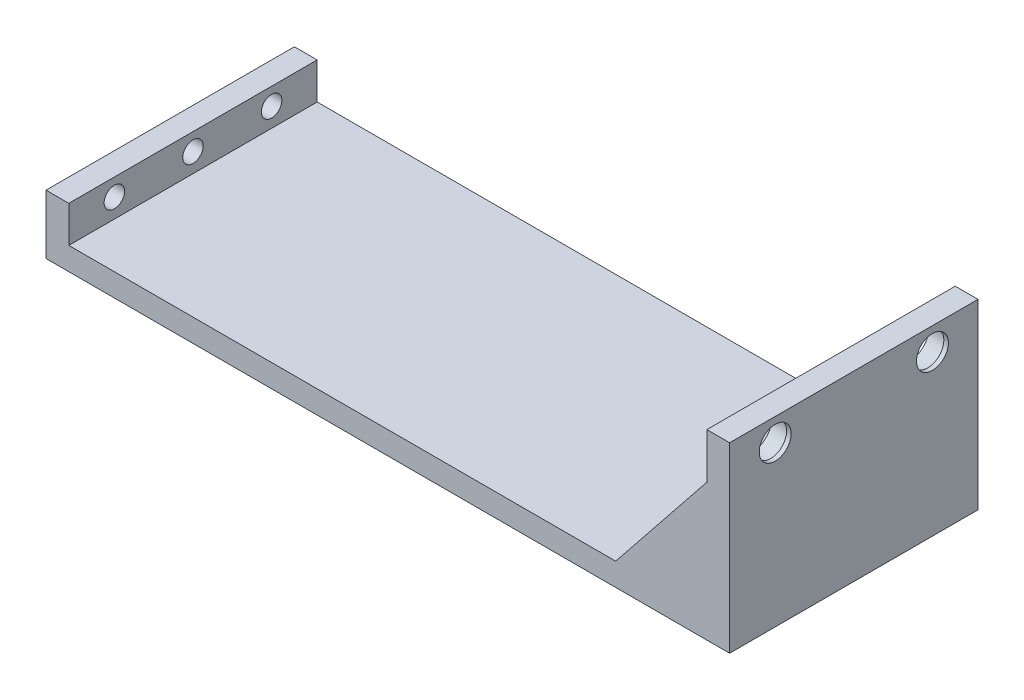
ISO-10303-21;
HEADER;
FILE_DESCRIPTION(('STEP AP214'),'2;1');
FILE_NAME('part.step','',(''),(''),'','','');
FILE_SCHEMA(('AUTOMOTIVE_DESIGN { 1 0 10303 214 1 1 1 1 }'));
ENDSEC;
DATA;
#1=APPLICATION_CONTEXT('core data for automotive mechanical design processes');
#2=APPLICATION_PROTOCOL_DEFINITION('international standard','automotive_design',2000,#1);
#3=PRODUCT_CONTEXT('',#1,'mechanical');
#4=PRODUCT('Part','Part','',(#3));
#5=PRODUCT_RELATED_PRODUCT_CATEGORY('part','',(#4));
#6=PRODUCT_DEFINITION_FORMATION('','',#4);
#7=PRODUCT_DEFINITION_CONTEXT('part definition',#1,'design');
#8=PRODUCT_DEFINITION('design','',#6,#7);
#9=PRODUCT_DEFINITION_SHAPE('','',#8);
#10=(LENGTH_UNIT() NAMED_UNIT(*) SI_UNIT(.MILLI.,.METRE.));
#11=(NAMED_UNIT(*) PLANE_ANGLE_UNIT() SI_UNIT($,.RADIAN.));
#12=(NAMED_UNIT(*) SI_UNIT($,.STERADIAN.) SOLID_ANGLE_UNIT());
#13=UNCERTAINTY_MEASURE_WITH_UNIT(LENGTH_MEASURE(1.E-05),#10,'distance_accuracy_value','');
#14=(GEOMETRIC_REPRESENTATION_CONTEXT(3) GLOBAL_UNCERTAINTY_ASSIGNED_CONTEXT((#13)) GLOBAL_UNIT_ASSIGNED_CONTEXT((#10,
#11,#12)) REPRESENTATION_CONTEXT('',''));
#15=CARTESIAN_POINT('',(0.,0.,0.));
#16=DIRECTION('',(0.,0.,1.));
#17=DIRECTION('',(1.,0.,0.));
#18=AXIS2_PLACEMENT_3D('',#15,#16,#17);
#19=CARTESIAN_POINT('',(51.8875361740346,40.,28.9393939393939));
#20=DIRECTION('',(1.,0.,0.));
#21=DIRECTION('',(0.,0.,-1.));
#22=AXIS2_PLACEMENT_3D('',#19,#20,#21);
#23=PLANE('',#22);
#24=DIRECTION('',(0.,-1.,0.));
#25=VECTOR('',#24,1.);
#26=CARTESIAN_POINT('',(51.8875361740346,40.,18.9393939393939));
#27=LINE('',#26,#25);
#28=CARTESIAN_POINT('',(51.8875361740346,30.,18.9393939393939));
#29=VERTEX_POINT('',#28);
#30=CARTESIAN_POINT('',(51.8875361740346,5.,18.9393939393939));
#31=VERTEX_POINT('',#30);
#32=EDGE_CURVE('E178',#29,#31,#27,.T.);
#33=ORIENTED_EDGE('',*,*,#32,.F.);
#34=DIRECTION('',(0.,0.,1.));
#35=VECTOR('',#34,1.);
#36=CARTESIAN_POINT('',(51.8875361740346,30.,28.9393939393939));
#37=LINE('',#36,#35);
#38=CARTESIAN_POINT('',(51.8875361740346,30.,28.9393939393939));
#39=VERTEX_POINT('',#38);
#40=EDGE_CURVE('E185',#29,#39,#37,.T.);
#41=ORIENTED_EDGE('',*,*,#40,.T.);
#42=DIRECTION('',(0.,-1.,0.));
#43=VECTOR('',#42,1.);
#44=CARTESIAN_POINT('',(51.8875361740346,40.,28.9393939393939));
#45=LINE('',#44,#43);
#46=CARTESIAN_POINT('',(51.8875361740346,40.,28.9393939393939));
#47=VERTEX_POINT('',#46);
#48=EDGE_CURVE('E229',#47,#39,#45,.T.);
#49=ORIENTED_EDGE('',*,*,#48,.F.);
#50=DIRECTION('',(0.,0.,1.));
#51=VECTOR('',#50,1.);
#52=CARTESIAN_POINT('',(51.8875361740346,40.,28.9393939393939));
#53=LINE('',#52,#51);
#54=CARTESIAN_POINT('',(51.8875361740346,40.,-25.5606060606061));
#55=VERTEX_POINT('',#54);
#56=EDGE_CURVE('E224',#55,#47,#53,.T.);
#57=ORIENTED_EDGE('',*,*,#56,.F.);
#58=DIRECTION('',(0.,-1.,0.));
#59=VECTOR('',#58,1.);
#60=CARTESIAN_POINT('',(51.8875361740346,40.,-25.5606060606061));
#61=LINE('',#60,#59);
#62=CARTESIAN_POINT('',(51.8875361740346,30.,-25.5606060606061));
#63=VERTEX_POINT('',#62);
#64=EDGE_CURVE('E233',#55,#63,#61,.T.);
#65=ORIENTED_EDGE('',*,*,#64,.T.);
#66=DIRECTION('',(0.,0.,-1.));
#67=VECTOR('',#66,1.);
#68=CARTESIAN_POINT('',(51.8875361740346,30.,28.9393939393939));
#69=LINE('',#68,#67);
#70=CARTESIAN_POINT('',(51.8875361740346,30.,-15.5606060606061));
#71=VERTEX_POINT('',#70);
#72=EDGE_CURVE('E201',#63,#71,#69,.F.);
#73=ORIENTED_EDGE('',*,*,#72,.T.);
#74=DIRECTION('',(0.,1.,0.));
#75=VECTOR('',#74,1.);
#76=CARTESIAN_POINT('',(51.8875361740346,40.,-15.5606060606061));
#77=LINE('',#76,#75);
#78=CARTESIAN_POINT('',(51.8875361740346,5.,-15.5606060606061));
#79=VERTEX_POINT('',#78);
#80=EDGE_CURVE('E194',#79,#71,#77,.T.);
#81=ORIENTED_EDGE('',*,*,#80,.F.);
#82=DIRECTION('',(0.,0.,1.));
#83=VECTOR('',#82,1.);
#84=CARTESIAN_POINT('',(51.8875361740346,5.,28.9393939393939));
#85=LINE('',#84,#83);
#86=EDGE_CURVE('E210',#79,#31,#85,.T.);
#87=ORIENTED_EDGE('',*,*,#86,.T.);
#88=EDGE_LOOP('',(#33,#41,#49,#57,#65,#73,#81,#87));
#89=FACE_BOUND('',#88,.T.);
#90=CARTESIAN_POINT('',(51.8875361740346,35.,18.939393939394));
#91=DIRECTION('',(-1.,0.,0.));
#92=DIRECTION('',(0.,0.,1.));
#93=AXIS2_PLACEMENT_3D('',#90,#91,#92);
#94=CIRCLE('',#93,4.25);
#95=CARTESIAN_POINT('',(51.8875361740346,35.,23.189393939394));
#96=VERTEX_POINT('',#95);
#97=EDGE_CURVE('E206',#96,#96,#94,.T.);
#98=ORIENTED_EDGE('',*,*,#97,.F.);
#99=EDGE_LOOP('',(#98));
#100=FACE_BOUND('',#99,.T.);
#101=CARTESIAN_POINT('',(51.8875361740346,35.,-15.5606060606061));
#102=DIRECTION('',(-1.,0.,0.));
#103=DIRECTION('',(0.,0.,1.));
#104=AXIS2_PLACEMENT_3D('',#101,#102,#103);
#105=CIRCLE('',#104,4.25);
#106=CARTESIAN_POINT('',(51.8875361740346,35.,-11.3106060606061));
#107=VERTEX_POINT('',#106);
#108=EDGE_CURVE('E211',#107,#107,#105,.T.);
#109=ORIENTED_EDGE('',*,*,#108,.F.);
#110=EDGE_LOOP('',(#109));
#111=FACE_BOUND('',#110,.T.);
#112=DIRECTION('',(0.,-1.,0.));
#113=VECTOR('',#112,1.);
#114=CARTESIAN_POINT('',(51.8875361740346,30.,-2.31060606060607));
#115=LINE('',#114,#113);
#116=CARTESIAN_POINT('',(51.8875361740346,30.,-2.31060606060607));
#117=VERTEX_POINT('',#116);
#118=CARTESIAN_POINT('',(51.8875361740346,28.,-2.31060606060607));
#119=VERTEX_POINT('',#118);
#120=EDGE_CURVE('E167',#117,#119,#115,.T.);
#121=ORIENTED_EDGE('',*,*,#120,.F.);
#122=DIRECTION('',(0.,0.,-1.));
#123=VECTOR('',#122,1.);
#124=CARTESIAN_POINT('',(51.8875361740346,30.,-2.31060606060607));
#125=LINE('',#124,#123);
#126=CARTESIAN_POINT('',(51.8875361740346,30.,5.68939393939393));
#127=VERTEX_POINT('',#126);
#128=EDGE_CURVE('E164',#127,#117,#125,.T.);
#129=ORIENTED_EDGE('',*,*,#128,.F.);
#130=DIRECTION('',(0.,1.,0.));
#131=VECTOR('',#130,1.);
#132=CARTESIAN_POINT('',(51.8875361740346,30.,5.68939393939393));
#133=LINE('',#132,#131);
#134=CARTESIAN_POINT('',(51.8875361740346,28.,5.68939393939393));
#135=VERTEX_POINT('',#134);
#136=EDGE_CURVE('E54',#135,#127,#133,.T.);
#137=ORIENTED_EDGE('',*,*,#136,.F.);
#138=DIRECTION('',(0.,0.,1.));
#139=VECTOR('',#138,1.);
#140=CARTESIAN_POINT('',(51.8875361740346,28.,-2.31060606060607));
#141=LINE('',#140,#139);
#142=EDGE_CURVE('E49',#119,#135,#141,.T.);
#143=ORIENTED_EDGE('',*,*,#142,.F.);
#144=EDGE_LOOP('',(#121,#129,#137,#143));
#145=FACE_BOUND('',#144,.T.);
#146=ADVANCED_FACE('F33',(#89,#100,#111,#145),#23,.F.);
#147=CARTESIAN_POINT('',(0.,5.,0.));
#148=DIRECTION('',(0.,1.,0.));
#149=DIRECTION('',(0.,0.,1.));
#150=AXIS2_PLACEMENT_3D('',#147,#148,#149);
#151=PLANE('',#150);
#152=DIRECTION('',(0.,0.,1.));
#153=VECTOR('',#152,1.);
#154=CARTESIAN_POINT('',(31.8875361740346,5.,0.));
#155=LINE('',#154,#153);
#156=CARTESIAN_POINT('',(31.8875361740346,5.,18.9393939393939));
#157=VERTEX_POINT('',#156);
#158=CARTESIAN_POINT('',(31.8875361740346,5.,28.9393939393939));
#159=VERTEX_POINT('',#158);
#160=EDGE_CURVE('E187',#157,#159,#155,.T.);
#161=ORIENTED_EDGE('',*,*,#160,.F.);
#162=DIRECTION('',(1.,0.,0.));
#163=VECTOR('',#162,1.);
#164=CARTESIAN_POINT('',(0.,5.,18.9393939393939));
#165=LINE('',#164,#163);
#166=EDGE_CURVE('E182',#157,#31,#165,.T.);
#167=ORIENTED_EDGE('',*,*,#166,.T.);
#168=ORIENTED_EDGE('',*,*,#86,.F.);
#169=DIRECTION('',(-1.,0.,0.));
#170=VECTOR('',#169,1.);
#171=CARTESIAN_POINT('',(0.,5.,-15.5606060606061));
#172=LINE('',#171,#170);
#173=CARTESIAN_POINT('',(31.8875361740346,5.,-15.5606060606061));
#174=VERTEX_POINT('',#173);
#175=EDGE_CURVE('E199',#79,#174,#172,.T.);
#176=ORIENTED_EDGE('',*,*,#175,.T.);
#177=DIRECTION('',(0.,0.,-1.));
#178=VECTOR('',#177,1.);
#179=CARTESIAN_POINT('',(31.8875361740346,5.,0.));
#180=LINE('',#179,#178);
#181=CARTESIAN_POINT('',(31.8875361740346,5.,-25.5606060606061));
#182=VERTEX_POINT('',#181);
#183=EDGE_CURVE('E203',#182,#174,#180,.F.);
#184=ORIENTED_EDGE('',*,*,#183,.F.);
#185=DIRECTION('',(-1.,0.,0.));
#186=VECTOR('',#185,1.);
#187=CARTESIAN_POINT('',(56.8875361740346,5.,-25.5606060606061));
#188=LINE('',#187,#186);
#189=CARTESIAN_POINT('',(-88.1124638259654,5.,-25.5606060606061));
#190=VERTEX_POINT('',#189);
#191=EDGE_CURVE('E270',#182,#190,#188,.T.);
#192=ORIENTED_EDGE('',*,*,#191,.T.);
#193=DIRECTION('',(0.,0.,-1.));
#194=VECTOR('',#193,1.);
#195=CARTESIAN_POINT('',(-88.1124638259654,5.,-25.5606060606061));
#196=LINE('',#195,#194);
#197=CARTESIAN_POINT('',(-88.1124638259654,5.,28.9393939393939));
#198=VERTEX_POINT('',#197);
#199=EDGE_CURVE('E250',#198,#190,#196,.T.);
#200=ORIENTED_EDGE('',*,*,#199,.F.);
#201=DIRECTION('',(1.,0.,0.));
#202=VECTOR('',#201,1.);
#203=CARTESIAN_POINT('',(56.8875361740345,5.,28.9393939393939));
#204=LINE('',#203,#202);
#205=EDGE_CURVE('E272',#198,#159,#204,.T.);
#206=ORIENTED_EDGE('',*,*,#205,.T.);
#207=EDGE_LOOP('',(#161,#167,#168,#176,#184,#192,#200,#206));
#208=FACE_BOUND('',#207,.T.);
#209=ADVANCED_FACE('F315',(#208),#151,.T.);
#210=CARTESIAN_POINT('',(56.8875361740345,5.,28.9393939393939));
#211=DIRECTION('',(-1.,0.,0.));
#212=DIRECTION('',(0.,0.,1.));
#213=AXIS2_PLACEMENT_3D('',#210,#211,#212);
#214=PLANE('',#213);
#215=CARTESIAN_POINT('',(56.8875361740346,35.,-15.5606060606061));
#216=DIRECTION('',(-1.,0.,0.));
#217=DIRECTION('',(0.,0.,1.));
#218=AXIS2_PLACEMENT_3D('',#215,#216,#217);
#219=CIRCLE('',#218,3.5);
#220=CARTESIAN_POINT('',(56.8875361740346,35.,-12.0606060606061));
#221=VERTEX_POINT('',#220);
#222=EDGE_CURVE('E642',#221,#221,#219,.T.);
#223=ORIENTED_EDGE('',*,*,#222,.T.);
#224=EDGE_LOOP('',(#223));
#225=FACE_BOUND('',#224,.T.);
#226=CARTESIAN_POINT('',(56.8875361740346,35.,18.939393939394));
#227=DIRECTION('',(-1.,0.,0.));
#228=DIRECTION('',(0.,0.,1.));
#229=AXIS2_PLACEMENT_3D('',#226,#227,#228);
#230=CIRCLE('',#229,3.5);
#231=CARTESIAN_POINT('',(56.8875361740346,35.,22.4393939393939));
#232=VERTEX_POINT('',#231);
#233=EDGE_CURVE('E646',#232,#232,#230,.T.);
#234=ORIENTED_EDGE('',*,*,#233,.T.);
#235=EDGE_LOOP('',(#234));
#236=FACE_BOUND('',#235,.T.);
#237=DIRECTION('',(0.,-1.,0.));
#238=VECTOR('',#237,1.);
#239=CARTESIAN_POINT('',(56.8875361740345,5.,28.9393939393939));
#240=LINE('',#239,#238);
#241=CARTESIAN_POINT('',(56.8875361740345,40.,28.9393939393939));
#242=VERTEX_POINT('',#241);
#243=CARTESIAN_POINT('',(56.8875361740345,0.,28.9393939393939));
#244=VERTEX_POINT('',#243);
#245=EDGE_CURVE('E275',#242,#244,#240,.T.);
#246=ORIENTED_EDGE('',*,*,#245,.T.);
#247=DIRECTION('',(0.,0.,-1.));
#248=VECTOR('',#247,1.);
#249=CARTESIAN_POINT('',(56.8875361740345,0.,28.9393939393939));
#250=LINE('',#249,#248);
#251=CARTESIAN_POINT('',(56.8875361740346,0.,-25.5606060606061));
#252=VERTEX_POINT('',#251);
#253=EDGE_CURVE('E269',#244,#252,#250,.T.);
#254=ORIENTED_EDGE('',*,*,#253,.T.);
#255=DIRECTION('',(0.,-1.,0.));
#256=VECTOR('',#255,1.);
#257=CARTESIAN_POINT('',(56.8875361740346,5.,-25.5606060606061));
#258=LINE('',#257,#256);
#259=CARTESIAN_POINT('',(56.8875361740346,40.,-25.5606060606061));
#260=VERTEX_POINT('',#259);
#261=EDGE_CURVE('E11',#260,#252,#258,.T.);
#262=ORIENTED_EDGE('',*,*,#261,.F.);
#263=DIRECTION('',(0.,0.,-1.));
#264=VECTOR('',#263,1.);
#265=CARTESIAN_POINT('',(56.8875361740345,40.,28.9393939393939));
#266=LINE('',#265,#264);
#267=EDGE_CURVE('E219',#242,#260,#266,.T.);
#268=ORIENTED_EDGE('',*,*,#267,.F.);
#269=EDGE_LOOP('',(#246,#254,#262,#268));
#270=FACE_BOUND('',#269,.T.);
#271=ADVANCED_FACE('F35',(#225,#236,#270),#214,.F.);
#272=CARTESIAN_POINT('',(56.8875361740346,5.,-25.5606060606061));
#273=DIRECTION('',(0.,0.,1.));
#274=DIRECTION('',(1.,0.,0.));
#275=AXIS2_PLACEMENT_3D('',#272,#273,#274);
#276=PLANE('',#275);
#277=ORIENTED_EDGE('',*,*,#191,.F.);
#278=DIRECTION('',(-0.624695047554424,-0.78086880944303,0.));
#279=VECTOR('',#278,1.);
#280=CARTESIAN_POINT('',(51.8875361740346,30.,-25.5606060606061));
#281=LINE('',#280,#279);
#282=EDGE_CURVE('E191',#63,#182,#281,.T.);
#283=ORIENTED_EDGE('',*,*,#282,.F.);
#284=ORIENTED_EDGE('',*,*,#64,.F.);
#285=DIRECTION('',(-1.,0.,0.));
#286=VECTOR('',#285,1.);
#287=CARTESIAN_POINT('',(56.8875361740346,40.,-25.5606060606061));
#288=LINE('',#287,#286);
#289=EDGE_CURVE('E222',#260,#55,#288,.T.);
#290=ORIENTED_EDGE('',*,*,#289,.F.);
#291=ORIENTED_EDGE('',*,*,#261,.T.);
#292=DIRECTION('',(-1.,0.,0.));
#293=VECTOR('',#292,1.);
#294=CARTESIAN_POINT('',(56.8875361740346,0.,-25.5606060606061));
#295=LINE('',#294,#293);
#296=CARTESIAN_POINT('',(-93.1124638259654,0.,-25.5606060606061));
#297=VERTEX_POINT('',#296);
#298=EDGE_CURVE('E277',#252,#297,#295,.T.);
#299=ORIENTED_EDGE('',*,*,#298,.T.);
#300=DIRECTION('',(0.,-1.,0.));
#301=VECTOR('',#300,1.);
#302=CARTESIAN_POINT('',(-93.1124638259654,5.,-25.5606060606061));
#303=LINE('',#302,#301);
#304=CARTESIAN_POINT('',(-93.1124638259654,13.,-25.5606060606061));
#305=VERTEX_POINT('',#304);
#306=EDGE_CURVE('E42',#305,#297,#303,.T.);
#307=ORIENTED_EDGE('',*,*,#306,.F.);
#308=DIRECTION('',(-1.,0.,0.));
#309=VECTOR('',#308,1.);
#310=CARTESIAN_POINT('',(-93.1124638259654,13.,-25.5606060606061));
#311=LINE('',#310,#309);
#312=CARTESIAN_POINT('',(-88.1124638259654,13.,-25.5606060606061));
#313=VERTEX_POINT('',#312);
#314=EDGE_CURVE('E258',#313,#305,#311,.T.);
#315=ORIENTED_EDGE('',*,*,#314,.F.);
#316=DIRECTION('',(0.,-1.,0.));
#317=VECTOR('',#316,1.);
#318=CARTESIAN_POINT('',(-88.1124638259654,13.,-25.5606060606061));
#319=LINE('',#318,#317);
#320=EDGE_CURVE('E261',#313,#190,#319,.T.);
#321=ORIENTED_EDGE('',*,*,#320,.T.);
#322=EDGE_LOOP('',(#277,#283,#284,#290,#291,#299,#307,#315,#321));
#323=FACE_BOUND('',#322,.T.);
#324=ADVANCED_FACE('F310',(#323),#276,.F.);
#325=CARTESIAN_POINT('',(-93.1124638259654,5.,28.9393939393939));
#326=DIRECTION('',(1.,0.,0.));
#327=DIRECTION('',(0.,0.,-1.));
#328=AXIS2_PLACEMENT_3D('',#325,#326,#327);
#329=PLANE('',#328);
#330=CARTESIAN_POINT('',(-93.1124638259654,9.2,-15.5606060606061));
#331=DIRECTION('',(-1.,0.,0.));
#332=DIRECTION('',(0.,0.,1.));
#333=AXIS2_PLACEMENT_3D('',#330,#331,#332);
#334=CIRCLE('',#333,2.24789999999999);
#335=CARTESIAN_POINT('',(-93.1124638259654,9.2,-13.3127060606061));
#336=VERTEX_POINT('',#335);
#337=EDGE_CURVE('E235',#336,#336,#334,.T.);
#338=ORIENTED_EDGE('',*,*,#337,.F.);
#339=EDGE_LOOP('',(#338));
#340=FACE_BOUND('',#339,.T.);
#341=CARTESIAN_POINT('',(-93.1124638259654,9.2,1.68939393939395));
#342=DIRECTION('',(-1.,0.,0.));
#343=DIRECTION('',(0.,0.,1.));
#344=AXIS2_PLACEMENT_3D('',#341,#342,#343);
#345=CIRCLE('',#344,2.24789999999999);
#346=CARTESIAN_POINT('',(-93.1124638259654,9.2,3.93729393939394));
#347=VERTEX_POINT('',#346);
#348=EDGE_CURVE('E241',#347,#347,#345,.T.);
#349=ORIENTED_EDGE('',*,*,#348,.F.);
#350=EDGE_LOOP('',(#349));
#351=FACE_BOUND('',#350,.T.);
#352=CARTESIAN_POINT('',(-93.1124638259654,9.2,18.939393939394));
#353=DIRECTION('',(-1.,0.,0.));
#354=DIRECTION('',(0.,0.,1.));
#355=AXIS2_PLACEMENT_3D('',#352,#353,#354);
#356=CIRCLE('',#355,2.24789999999999);
#357=CARTESIAN_POINT('',(-93.1124638259654,9.2,21.1872939393939));
#358=VERTEX_POINT('',#357);
#359=EDGE_CURVE('E244',#358,#358,#356,.T.);
#360=ORIENTED_EDGE('',*,*,#359,.F.);
#361=EDGE_LOOP('',(#360));
#362=FACE_BOUND('',#361,.T.);
#363=DIRECTION('',(0.,0.,1.));
#364=VECTOR('',#363,1.);
#365=CARTESIAN_POINT('',(-93.1124638259654,0.,28.9393939393939));
#366=LINE('',#365,#364);
#367=CARTESIAN_POINT('',(-93.1124638259654,0.,28.9393939393939));
#368=VERTEX_POINT('',#367);
#369=EDGE_CURVE('E279',#297,#368,#366,.T.);
#370=ORIENTED_EDGE('',*,*,#369,.T.);
#371=DIRECTION('',(0.,-1.,0.));
#372=VECTOR('',#371,1.);
#373=CARTESIAN_POINT('',(-93.1124638259654,5.,28.9393939393939));
#374=LINE('',#373,#372);
#375=CARTESIAN_POINT('',(-93.1124638259654,13.,28.9393939393939));
#376=VERTEX_POINT('',#375);
#377=EDGE_CURVE('E284',#376,#368,#374,.T.);
#378=ORIENTED_EDGE('',*,*,#377,.F.);
#379=DIRECTION('',(0.,0.,1.));
#380=VECTOR('',#379,1.);
#381=CARTESIAN_POINT('',(-93.1124638259654,13.,-25.5606060606061));
#382=LINE('',#381,#380);
#383=EDGE_CURVE('E251',#305,#376,#382,.T.);
#384=ORIENTED_EDGE('',*,*,#383,.F.);
#385=ORIENTED_EDGE('',*,*,#306,.T.);
#386=EDGE_LOOP('',(#370,#378,#384,#385));
#387=FACE_BOUND('',#386,.T.);
#388=ADVANCED_FACE('F291',(#340,#351,#362,#387),#329,.F.);
#389=CARTESIAN_POINT('',(56.8875361740345,5.,28.9393939393939));
#390=DIRECTION('',(0.,0.,-1.));
#391=DIRECTION('',(-1.,0.,0.));
#392=AXIS2_PLACEMENT_3D('',#389,#390,#391);
#393=PLANE('',#392);
#394=DIRECTION('',(1.,0.,0.));
#395=VECTOR('',#394,1.);
#396=CARTESIAN_POINT('',(56.8875361740345,0.,28.9393939393939));
#397=LINE('',#396,#395);
#398=EDGE_CURVE('E273',#368,#244,#397,.T.);
#399=ORIENTED_EDGE('',*,*,#398,.T.);
#400=ORIENTED_EDGE('',*,*,#245,.F.);
#401=DIRECTION('',(1.,0.,0.));
#402=VECTOR('',#401,1.);
#403=CARTESIAN_POINT('',(56.8875361740345,40.,28.9393939393939));
#404=LINE('',#403,#402);
#405=EDGE_CURVE('E226',#47,#242,#404,.T.);
#406=ORIENTED_EDGE('',*,*,#405,.F.);
#407=ORIENTED_EDGE('',*,*,#48,.T.);
#408=DIRECTION('',(-0.624695047554424,-0.78086880944303,0.));
#409=VECTOR('',#408,1.);
#410=CARTESIAN_POINT('',(51.8875361740346,30.,28.9393939393939));
#411=LINE('',#410,#409);
#412=EDGE_CURVE('E171',#39,#159,#411,.T.);
#413=ORIENTED_EDGE('',*,*,#412,.T.);
#414=ORIENTED_EDGE('',*,*,#205,.F.);
#415=DIRECTION('',(0.,-1.,0.));
#416=VECTOR('',#415,1.);
#417=CARTESIAN_POINT('',(-88.1124638259654,13.,28.9393939393939));
#418=LINE('',#417,#416);
#419=CARTESIAN_POINT('',(-88.1124638259654,13.,28.9393939393939));
#420=VERTEX_POINT('',#419);
#421=EDGE_CURVE('E266',#420,#198,#418,.T.);
#422=ORIENTED_EDGE('',*,*,#421,.F.);
#423=DIRECTION('',(1.,0.,0.));
#424=VECTOR('',#423,1.);
#425=CARTESIAN_POINT('',(-93.1124638259654,13.,28.9393939393939));
#426=LINE('',#425,#424);
#427=EDGE_CURVE('E254',#376,#420,#426,.T.);
#428=ORIENTED_EDGE('',*,*,#427,.F.);
#429=ORIENTED_EDGE('',*,*,#377,.T.);
#430=EDGE_LOOP('',(#399,#400,#406,#407,#413,#414,#422,#428,#429));
#431=FACE_BOUND('',#430,.T.);
#432=ADVANCED_FACE('F300',(#431),#393,.F.);
#433=CARTESIAN_POINT('',(0.,0.,0.));
#434=DIRECTION('',(0.,1.,0.));
#435=DIRECTION('',(0.,0.,1.));
#436=AXIS2_PLACEMENT_3D('',#433,#434,#435);
#437=PLANE('',#436);
#438=ORIENTED_EDGE('',*,*,#253,.F.);
#439=ORIENTED_EDGE('',*,*,#398,.F.);
#440=ORIENTED_EDGE('',*,*,#369,.F.);
#441=ORIENTED_EDGE('',*,*,#298,.F.);
#442=EDGE_LOOP('',(#438,#439,#440,#441));
#443=FACE_BOUND('',#442,.T.);
#444=ADVANCED_FACE('F298',(#443),#437,.F.);
#445=CARTESIAN_POINT('',(-88.1124638259654,13.,-25.5606060606061));
#446=DIRECTION('',(-1.,0.,0.));
#447=DIRECTION('',(0.,0.,1.));
#448=AXIS2_PLACEMENT_3D('',#445,#446,#447);
#449=PLANE('',#448);
#450=CARTESIAN_POINT('',(-88.1124638259654,9.2,-15.5606060606061));
#451=DIRECTION('',(-1.,0.,0.));
#452=DIRECTION('',(0.,0.,1.));
#453=AXIS2_PLACEMENT_3D('',#450,#451,#452);
#454=CIRCLE('',#453,2.24789999999999);
#455=CARTESIAN_POINT('',(-88.1124638259654,9.2,-13.3127060606061));
#456=VERTEX_POINT('',#455);
#457=EDGE_CURVE('E238',#456,#456,#454,.T.);
#458=ORIENTED_EDGE('',*,*,#457,.T.);
#459=EDGE_LOOP('',(#458));
#460=FACE_BOUND('',#459,.T.);
#461=CARTESIAN_POINT('',(-88.1124638259654,9.2,1.68939393939395));
#462=DIRECTION('',(-1.,0.,0.));
#463=DIRECTION('',(0.,0.,1.));
#464=AXIS2_PLACEMENT_3D('',#461,#462,#463);
#465=CIRCLE('',#464,2.24789999999999);
#466=CARTESIAN_POINT('',(-88.1124638259654,9.2,3.93729393939394));
#467=VERTEX_POINT('',#466);
#468=EDGE_CURVE('E37',#467,#467,#465,.T.);
#469=ORIENTED_EDGE('',*,*,#468,.T.);
#470=EDGE_LOOP('',(#469));
#471=FACE_BOUND('',#470,.T.);
#472=CARTESIAN_POINT('',(-88.1124638259654,9.2,18.939393939394));
#473=DIRECTION('',(-1.,0.,0.));
#474=DIRECTION('',(0.,0.,1.));
#475=AXIS2_PLACEMENT_3D('',#472,#473,#474);
#476=CIRCLE('',#475,2.24789999999999);
#477=CARTESIAN_POINT('',(-88.1124638259654,9.2,21.1872939393939));
#478=VERTEX_POINT('',#477);
#479=EDGE_CURVE('E247',#478,#478,#476,.T.);
#480=ORIENTED_EDGE('',*,*,#479,.T.);
#481=EDGE_LOOP('',(#480));
#482=FACE_BOUND('',#481,.T.);
#483=ORIENTED_EDGE('',*,*,#199,.T.);
#484=ORIENTED_EDGE('',*,*,#320,.F.);
#485=DIRECTION('',(0.,0.,-1.));
#486=VECTOR('',#485,1.);
#487=CARTESIAN_POINT('',(-88.1124638259654,13.,-25.5606060606061));
#488=LINE('',#487,#486);
#489=EDGE_CURVE('E256',#420,#313,#488,.T.);
#490=ORIENTED_EDGE('',*,*,#489,.F.);
#491=ORIENTED_EDGE('',*,*,#421,.T.);
#492=EDGE_LOOP('',(#483,#484,#490,#491));
#493=FACE_BOUND('',#492,.T.);
#494=ADVANCED_FACE('F313',(#460,#471,#482,#493),#449,.F.);
#495=CARTESIAN_POINT('',(0.,13.,0.));
#496=DIRECTION('',(0.,1.,0.));
#497=DIRECTION('',(0.,0.,1.));
#498=AXIS2_PLACEMENT_3D('',#495,#496,#497);
#499=PLANE('',#498);
#500=ORIENTED_EDGE('',*,*,#383,.T.);
#501=ORIENTED_EDGE('',*,*,#427,.T.);
#502=ORIENTED_EDGE('',*,*,#489,.T.);
#503=ORIENTED_EDGE('',*,*,#314,.T.);
#504=EDGE_LOOP('',(#500,#501,#502,#503));
#505=FACE_BOUND('',#504,.T.);
#506=ADVANCED_FACE('F307',(#505),#499,.T.);
#507=CARTESIAN_POINT('',(-93.1124638259654,9.2,18.939393939394));
#508=DIRECTION('',(-1.,0.,0.));
#509=DIRECTION('',(0.,0.,1.));
#510=AXIS2_PLACEMENT_3D('',#507,#508,#509);
#511=CYLINDRICAL_SURFACE('',#510,2.24789999999999);
#512=ORIENTED_EDGE('',*,*,#359,.T.);
#513=EDGE_LOOP('',(#512));
#514=FACE_BOUND('',#513,.T.);
#515=ORIENTED_EDGE('',*,*,#479,.F.);
#516=EDGE_LOOP('',(#515));
#517=FACE_BOUND('',#516,.T.);
#518=ADVANCED_FACE('F365',(#514,#517),#511,.F.);
#519=CARTESIAN_POINT('',(-93.1124638259654,9.2,1.68939393939395));
#520=DIRECTION('',(-1.,0.,0.));
#521=DIRECTION('',(0.,0.,1.));
#522=AXIS2_PLACEMENT_3D('',#519,#520,#521);
#523=CYLINDRICAL_SURFACE('',#522,2.24789999999999);
#524=ORIENTED_EDGE('',*,*,#348,.T.);
#525=EDGE_LOOP('',(#524));
#526=FACE_BOUND('',#525,.T.);
#527=ORIENTED_EDGE('',*,*,#468,.F.);
#528=EDGE_LOOP('',(#527));
#529=FACE_BOUND('',#528,.T.);
#530=ADVANCED_FACE('F361',(#526,#529),#523,.F.);
#531=CARTESIAN_POINT('',(-93.1124638259654,9.2,-15.5606060606061));
#532=DIRECTION('',(-1.,0.,0.));
#533=DIRECTION('',(0.,0.,1.));
#534=AXIS2_PLACEMENT_3D('',#531,#532,#533);
#535=CYLINDRICAL_SURFACE('',#534,2.24789999999999);
#536=ORIENTED_EDGE('',*,*,#337,.T.);
#537=EDGE_LOOP('',(#536));
#538=FACE_BOUND('',#537,.T.);
#539=ORIENTED_EDGE('',*,*,#457,.F.);
#540=EDGE_LOOP('',(#539));
#541=FACE_BOUND('',#540,.T.);
#542=ADVANCED_FACE('F358',(#538,#541),#535,.F.);
#543=CARTESIAN_POINT('',(0.,40.,0.));
#544=DIRECTION('',(0.,1.,0.));
#545=DIRECTION('',(0.,0.,1.));
#546=AXIS2_PLACEMENT_3D('',#543,#544,#545);
#547=PLANE('',#546);
#548=ORIENTED_EDGE('',*,*,#267,.T.);
#549=ORIENTED_EDGE('',*,*,#289,.T.);
#550=ORIENTED_EDGE('',*,*,#56,.T.);
#551=ORIENTED_EDGE('',*,*,#405,.T.);
#552=EDGE_LOOP('',(#548,#549,#550,#551));
#553=FACE_BOUND('',#552,.T.);
#554=ADVANCED_FACE('F339',(#553),#547,.T.);
#555=CARTESIAN_POINT('',(55.8875361740346,35.,18.939393939394));
#556=DIRECTION('',(-1.,0.,0.));
#557=DIRECTION('',(0.,0.,1.));
#558=AXIS2_PLACEMENT_3D('',#555,#556,#557);
#559=CYLINDRICAL_SURFACE('',#558,4.25);
#560=CARTESIAN_POINT('',(55.8875361740346,35.,18.939393939394));
#561=DIRECTION('',(-1.,0.,0.));
#562=DIRECTION('',(0.,0.,1.));
#563=AXIS2_PLACEMENT_3D('',#560,#561,#562);
#564=CIRCLE('',#563,4.25);
#565=CARTESIAN_POINT('',(55.8875361740346,35.,23.189393939394));
#566=VERTEX_POINT('',#565);
#567=EDGE_CURVE('E214',#566,#566,#564,.T.);
#568=ORIENTED_EDGE('',*,*,#567,.F.);
#569=EDGE_LOOP('',(#568));
#570=FACE_BOUND('',#569,.T.);
#571=ORIENTED_EDGE('',*,*,#97,.T.);
#572=EDGE_LOOP('',(#571));
#573=FACE_BOUND('',#572,.T.);
#574=ADVANCED_FACE('F435',(#570,#573),#559,.F.);
#575=CARTESIAN_POINT('',(55.8875361740346,35.,18.939393939394));
#576=DIRECTION('',(-1.,0.,0.));
#577=DIRECTION('',(0.,0.,1.));
#578=AXIS2_PLACEMENT_3D('',#575,#576,#577);
#579=PLANE('',#578);
#580=CARTESIAN_POINT('',(55.8875361740346,35.,18.939393939394));
#581=DIRECTION('',(-1.,0.,0.));
#582=DIRECTION('',(0.,0.,1.));
#583=AXIS2_PLACEMENT_3D('',#580,#581,#582);
#584=CIRCLE('',#583,3.5);
#585=CARTESIAN_POINT('',(55.8875361740346,35.,22.4393939393939));
#586=VERTEX_POINT('',#585);
#587=EDGE_CURVE('E651',#586,#586,#584,.T.);
#588=ORIENTED_EDGE('',*,*,#587,.F.);
#589=EDGE_LOOP('',(#588));
#590=FACE_BOUND('',#589,.T.);
#591=ORIENTED_EDGE('',*,*,#567,.T.);
#592=EDGE_LOOP('',(#591));
#593=FACE_BOUND('',#592,.T.);
#594=ADVANCED_FACE('F440',(#590,#593),#579,.T.);
#595=CARTESIAN_POINT('',(55.8875361740346,35.,-15.5606060606061));
#596=DIRECTION('',(-1.,0.,0.));
#597=DIRECTION('',(0.,0.,1.));
#598=AXIS2_PLACEMENT_3D('',#595,#596,#597);
#599=CYLINDRICAL_SURFACE('',#598,4.25);
#600=CARTESIAN_POINT('',(55.8875361740346,35.,-15.5606060606061));
#601=DIRECTION('',(-1.,0.,0.));
#602=DIRECTION('',(0.,0.,1.));
#603=AXIS2_PLACEMENT_3D('',#600,#601,#602);
#604=CIRCLE('',#603,4.25);
#605=CARTESIAN_POINT('',(55.8875361740346,35.,-11.3106060606061));
#606=VERTEX_POINT('',#605);
#607=EDGE_CURVE('E207',#606,#606,#604,.T.);
#608=ORIENTED_EDGE('',*,*,#607,.F.);
#609=EDGE_LOOP('',(#608));
#610=FACE_BOUND('',#609,.T.);
#611=ORIENTED_EDGE('',*,*,#108,.T.);
#612=EDGE_LOOP('',(#611));
#613=FACE_BOUND('',#612,.T.);
#614=ADVANCED_FACE('F448',(#610,#613),#599,.F.);
#615=CARTESIAN_POINT('',(55.8875361740346,35.,-15.5606060606061));
#616=DIRECTION('',(-1.,0.,0.));
#617=DIRECTION('',(0.,0.,1.));
#618=AXIS2_PLACEMENT_3D('',#615,#616,#617);
#619=PLANE('',#618);
#620=CARTESIAN_POINT('',(55.8875361740346,35.,-15.5606060606061));
#621=DIRECTION('',(-1.,0.,0.));
#622=DIRECTION('',(0.,0.,1.));
#623=AXIS2_PLACEMENT_3D('',#620,#621,#622);
#624=CIRCLE('',#623,3.5);
#625=CARTESIAN_POINT('',(55.8875361740346,35.,-12.0606060606061));
#626=VERTEX_POINT('',#625);
#627=EDGE_CURVE('E645',#626,#626,#624,.T.);
#628=ORIENTED_EDGE('',*,*,#627,.F.);
#629=EDGE_LOOP('',(#628));
#630=FACE_BOUND('',#629,.T.);
#631=ORIENTED_EDGE('',*,*,#607,.T.);
#632=EDGE_LOOP('',(#631));
#633=FACE_BOUND('',#632,.T.);
#634=ADVANCED_FACE('F457',(#630,#633),#619,.T.);
#635=CARTESIAN_POINT('',(51.8875361740346,30.,-25.5606060606061));
#636=DIRECTION('',(0.780868809443031,-0.624695047554424,0.));
#637=DIRECTION('',(-0.624695047554424,-0.78086880944303,0.));
#638=AXIS2_PLACEMENT_3D('',#635,#636,#637);
#639=PLANE('',#638);
#640=ORIENTED_EDGE('',*,*,#282,.T.);
#641=ORIENTED_EDGE('',*,*,#183,.T.);
#642=DIRECTION('',(-0.624695047554424,-0.78086880944303,0.));
#643=VECTOR('',#642,1.);
#644=CARTESIAN_POINT('',(51.8875361740346,30.,-15.5606060606061));
#645=LINE('',#644,#643);
#646=EDGE_CURVE('E190',#71,#174,#645,.T.);
#647=ORIENTED_EDGE('',*,*,#646,.F.);
#648=ORIENTED_EDGE('',*,*,#72,.F.);
#649=EDGE_LOOP('',(#640,#641,#647,#648));
#650=FACE_BOUND('',#649,.T.);
#651=ADVANCED_FACE('F334',(#650),#639,.F.);
#652=CARTESIAN_POINT('',(-18.1124638259654,20.,-15.5606060606061));
#653=DIRECTION('',(0.,0.,-1.));
#654=DIRECTION('',(-1.,0.,0.));
#655=AXIS2_PLACEMENT_3D('',#652,#653,#654);
#656=PLANE('',#655);
#657=ORIENTED_EDGE('',*,*,#175,.F.);
#658=ORIENTED_EDGE('',*,*,#80,.T.);
#659=ORIENTED_EDGE('',*,*,#646,.T.);
#660=EDGE_LOOP('',(#657,#658,#659));
#661=FACE_BOUND('',#660,.T.);
#662=ADVANCED_FACE('F330',(#661),#656,.F.);
#663=CARTESIAN_POINT('',(51.8875361740346,30.,28.9393939393939));
#664=DIRECTION('',(-0.78086880944303,0.624695047554424,0.));
#665=DIRECTION('',(-0.624695047554424,-0.78086880944303,0.));
#666=AXIS2_PLACEMENT_3D('',#663,#664,#665);
#667=PLANE('',#666);
#668=DIRECTION('',(-0.624695047554424,-0.78086880944303,0.));
#669=VECTOR('',#668,1.);
#670=CARTESIAN_POINT('',(51.8875361740346,30.,18.9393939393939));
#671=LINE('',#670,#669);
#672=EDGE_CURVE('E168',#29,#157,#671,.T.);
#673=ORIENTED_EDGE('',*,*,#672,.T.);
#674=ORIENTED_EDGE('',*,*,#160,.T.);
#675=ORIENTED_EDGE('',*,*,#412,.F.);
#676=ORIENTED_EDGE('',*,*,#40,.F.);
#677=EDGE_LOOP('',(#673,#674,#675,#676));
#678=FACE_BOUND('',#677,.T.);
#679=ADVANCED_FACE('F320',(#678),#667,.T.);
#680=CARTESIAN_POINT('',(-18.1124638259654,20.,18.9393939393939));
#681=DIRECTION('',(0.,0.,1.));
#682=DIRECTION('',(1.,0.,0.));
#683=AXIS2_PLACEMENT_3D('',#680,#681,#682);
#684=PLANE('',#683);
#685=ORIENTED_EDGE('',*,*,#166,.F.);
#686=ORIENTED_EDGE('',*,*,#672,.F.);
#687=ORIENTED_EDGE('',*,*,#32,.T.);
#688=EDGE_LOOP('',(#685,#686,#687));
#689=FACE_BOUND('',#688,.T.);
#690=ADVANCED_FACE('F325',(#689),#684,.F.);
#691=CARTESIAN_POINT('',(46.8875361740346,30.,-2.31060606060607));
#692=DIRECTION('',(0.,0.,1.));
#693=DIRECTION('',(0.,-1.,0.));
#694=AXIS2_PLACEMENT_3D('',#691,#692,#693);
#695=PLANE('',#694);
#696=ORIENTED_EDGE('',*,*,#120,.T.);
#697=DIRECTION('',(1.,0.,0.));
#698=VECTOR('',#697,1.);
#699=CARTESIAN_POINT('',(46.8875361740346,28.,-2.31060606060607));
#700=LINE('',#699,#698);
#701=CARTESIAN_POINT('',(46.8875361740346,28.,-2.31060606060607));
#702=VERTEX_POINT('',#701);
#703=EDGE_CURVE('E148',#702,#119,#700,.T.);
#704=ORIENTED_EDGE('',*,*,#703,.F.);
#705=DIRECTION('',(0.,-1.,0.));
#706=VECTOR('',#705,1.);
#707=CARTESIAN_POINT('',(46.8875361740346,30.,-2.31060606060607));
#708=LINE('',#707,#706);
#709=CARTESIAN_POINT('',(46.8875361740346,30.,-2.31060606060607));
#710=VERTEX_POINT('',#709);
#711=EDGE_CURVE('E155',#710,#702,#708,.T.);
#712=ORIENTED_EDGE('',*,*,#711,.F.);
#713=DIRECTION('',(1.,0.,0.));
#714=VECTOR('',#713,1.);
#715=CARTESIAN_POINT('',(46.8875361740346,30.,-2.31060606060607));
#716=LINE('',#715,#714);
#717=EDGE_CURVE('E663',#710,#117,#716,.T.);
#718=ORIENTED_EDGE('',*,*,#717,.T.);
#719=EDGE_LOOP('',(#696,#704,#712,#718));
#720=FACE_BOUND('',#719,.T.);
#721=ADVANCED_FACE('F166',(#720),#695,.F.);
#722=CARTESIAN_POINT('',(46.8875361740346,28.,-2.31060606060607));
#723=DIRECTION('',(0.,1.,0.));
#724=DIRECTION('',(0.,0.,1.));
#725=AXIS2_PLACEMENT_3D('',#722,#723,#724);
#726=PLANE('',#725);
#727=CARTESIAN_POINT('',(49.3875361740346,28.,1.68939393939393));
#728=DIRECTION('',(0.,1.,0.));
#729=DIRECTION('',(0.,0.,1.));
#730=AXIS2_PLACEMENT_3D('',#727,#728,#729);
#731=CIRCLE('',#730,2.);
#732=CARTESIAN_POINT('',(49.3875361740346,28.,3.68939393939393));
#733=VERTEX_POINT('',#732);
#734=EDGE_CURVE('E656',#733,#733,#731,.T.);
#735=ORIENTED_EDGE('',*,*,#734,.T.);
#736=EDGE_LOOP('',(#735));
#737=FACE_BOUND('',#736,.T.);
#738=ORIENTED_EDGE('',*,*,#142,.T.);
#739=DIRECTION('',(1.,0.,0.));
#740=VECTOR('',#739,1.);
#741=CARTESIAN_POINT('',(46.8875361740346,28.,5.68939393939393));
#742=LINE('',#741,#740);
#743=CARTESIAN_POINT('',(46.8875361740346,28.,5.68939393939393));
#744=VERTEX_POINT('',#743);
#745=EDGE_CURVE('E151',#744,#135,#742,.T.);
#746=ORIENTED_EDGE('',*,*,#745,.F.);
#747=DIRECTION('',(0.,0.,1.));
#748=VECTOR('',#747,1.);
#749=CARTESIAN_POINT('',(46.8875361740346,28.,-2.31060606060607));
#750=LINE('',#749,#748);
#751=EDGE_CURVE('E144',#702,#744,#750,.T.);
#752=ORIENTED_EDGE('',*,*,#751,.F.);
#753=ORIENTED_EDGE('',*,*,#703,.T.);
#754=EDGE_LOOP('',(#738,#746,#752,#753));
#755=FACE_BOUND('',#754,.T.);
#756=ADVANCED_FACE('F146',(#737,#755),#726,.F.);
#757=CARTESIAN_POINT('',(46.8875361740346,30.,5.68939393939393));
#758=DIRECTION('',(0.,0.,-1.));
#759=DIRECTION('',(0.,1.,0.));
#760=AXIS2_PLACEMENT_3D('',#757,#758,#759);
#761=PLANE('',#760);
#762=ORIENTED_EDGE('',*,*,#136,.T.);
#763=DIRECTION('',(1.,0.,0.));
#764=VECTOR('',#763,1.);
#765=CARTESIAN_POINT('',(46.8875361740346,30.,5.68939393939393));
#766=LINE('',#765,#764);
#767=CARTESIAN_POINT('',(46.8875361740346,30.,5.68939393939393));
#768=VERTEX_POINT('',#767);
#769=EDGE_CURVE('E173',#768,#127,#766,.T.);
#770=ORIENTED_EDGE('',*,*,#769,.F.);
#771=DIRECTION('',(0.,1.,0.));
#772=VECTOR('',#771,1.);
#773=CARTESIAN_POINT('',(46.8875361740346,30.,5.68939393939393));
#774=LINE('',#773,#772);
#775=EDGE_CURVE('E154',#744,#768,#774,.T.);
#776=ORIENTED_EDGE('',*,*,#775,.F.);
#777=ORIENTED_EDGE('',*,*,#745,.T.);
#778=EDGE_LOOP('',(#762,#770,#776,#777));
#779=FACE_BOUND('',#778,.T.);
#780=ADVANCED_FACE('F502',(#779),#761,.F.);
#781=CARTESIAN_POINT('',(46.8875361740346,30.,-2.31060606060607));
#782=DIRECTION('',(0.,-1.,0.));
#783=DIRECTION('',(0.,0.,-1.));
#784=AXIS2_PLACEMENT_3D('',#781,#782,#783);
#785=PLANE('',#784);
#786=CARTESIAN_POINT('',(49.3875361740346,30.,1.68939393939393));
#787=DIRECTION('',(0.,1.,0.));
#788=DIRECTION('',(0.,0.,1.));
#789=AXIS2_PLACEMENT_3D('',#786,#787,#788);
#790=CIRCLE('',#789,2.);
#791=CARTESIAN_POINT('',(49.3875361740346,30.,3.68939393939393));
#792=VERTEX_POINT('',#791);
#793=EDGE_CURVE('E648',#792,#792,#790,.T.);
#794=ORIENTED_EDGE('',*,*,#793,.F.);
#795=EDGE_LOOP('',(#794));
#796=FACE_BOUND('',#795,.T.);
#797=ORIENTED_EDGE('',*,*,#128,.T.);
#798=ORIENTED_EDGE('',*,*,#717,.F.);
#799=DIRECTION('',(0.,0.,-1.));
#800=VECTOR('',#799,1.);
#801=CARTESIAN_POINT('',(46.8875361740346,30.,-2.31060606060607));
#802=LINE('',#801,#800);
#803=EDGE_CURVE('E160',#768,#710,#802,.T.);
#804=ORIENTED_EDGE('',*,*,#803,.F.);
#805=ORIENTED_EDGE('',*,*,#769,.T.);
#806=EDGE_LOOP('',(#797,#798,#804,#805));
#807=FACE_BOUND('',#806,.T.);
#808=ADVANCED_FACE('F511',(#796,#807),#785,.F.);
#809=CARTESIAN_POINT('',(46.8875361740346,0.,0.));
#810=DIRECTION('',(-1.,0.,0.));
#811=DIRECTION('',(0.,0.,1.));
#812=AXIS2_PLACEMENT_3D('',#809,#810,#811);
#813=PLANE('',#812);
#814=ORIENTED_EDGE('',*,*,#711,.T.);
#815=ORIENTED_EDGE('',*,*,#751,.T.);
#816=ORIENTED_EDGE('',*,*,#775,.T.);
#817=ORIENTED_EDGE('',*,*,#803,.T.);
#818=EDGE_LOOP('',(#814,#815,#816,#817));
#819=FACE_BOUND('',#818,.T.);
#820=ADVANCED_FACE('F158',(#819),#813,.T.);
#821=CARTESIAN_POINT('',(49.3875361740346,28.,1.68939393939393));
#822=DIRECTION('',(0.,1.,0.));
#823=DIRECTION('',(0.,0.,1.));
#824=AXIS2_PLACEMENT_3D('',#821,#822,#823);
#825=CYLINDRICAL_SURFACE('',#824,2.);
#826=ORIENTED_EDGE('',*,*,#734,.F.);
#827=EDGE_LOOP('',(#826));
#828=FACE_BOUND('',#827,.T.);
#829=ORIENTED_EDGE('',*,*,#793,.T.);
#830=EDGE_LOOP('',(#829));
#831=FACE_BOUND('',#830,.T.);
#832=ADVANCED_FACE('F525',(#828,#831),#825,.F.);
#833=CARTESIAN_POINT('',(56.8875361740346,35.,18.939393939394));
#834=DIRECTION('',(-1.,0.,0.));
#835=DIRECTION('',(0.,0.,1.));
#836=AXIS2_PLACEMENT_3D('',#833,#834,#835);
#837=CYLINDRICAL_SURFACE('',#836,3.5);
#838=ORIENTED_EDGE('',*,*,#233,.F.);
#839=EDGE_LOOP('',(#838));
#840=FACE_BOUND('',#839,.T.);
#841=ORIENTED_EDGE('',*,*,#587,.T.);
#842=EDGE_LOOP('',(#841));
#843=FACE_BOUND('',#842,.T.);
#844=ADVANCED_FACE('F531',(#840,#843),#837,.F.);
#845=CARTESIAN_POINT('',(56.8875361740346,35.,-15.5606060606061));
#846=DIRECTION('',(-1.,0.,0.));
#847=DIRECTION('',(0.,0.,1.));
#848=AXIS2_PLACEMENT_3D('',#845,#846,#847);
#849=CYLINDRICAL_SURFACE('',#848,3.5);
#850=ORIENTED_EDGE('',*,*,#222,.F.);
#851=EDGE_LOOP('',(#850));
#852=FACE_BOUND('',#851,.T.);
#853=ORIENTED_EDGE('',*,*,#627,.T.);
#854=EDGE_LOOP('',(#853));
#855=FACE_BOUND('',#854,.T.);
#856=ADVANCED_FACE('F538',(#852,#855),#849,.F.);
#857=CLOSED_SHELL('',(#146,#209,#271,#324,#388,#432,#444,#494,#506,#518,#530,#542,#554,#574,
#594,#614,#634,#651,#662,#679,#690,#721,#756,#780,#808,#820,#832,#844,#856));
#858=MANIFOLD_SOLID_BREP('B2',#857);
#859=ADVANCED_BREP_SHAPE_REPRESENTATION('',(#18,#858),#14);
#860=SHAPE_DEFINITION_REPRESENTATION(#9,#859);
ENDSEC;
END-ISO-10303-21;
